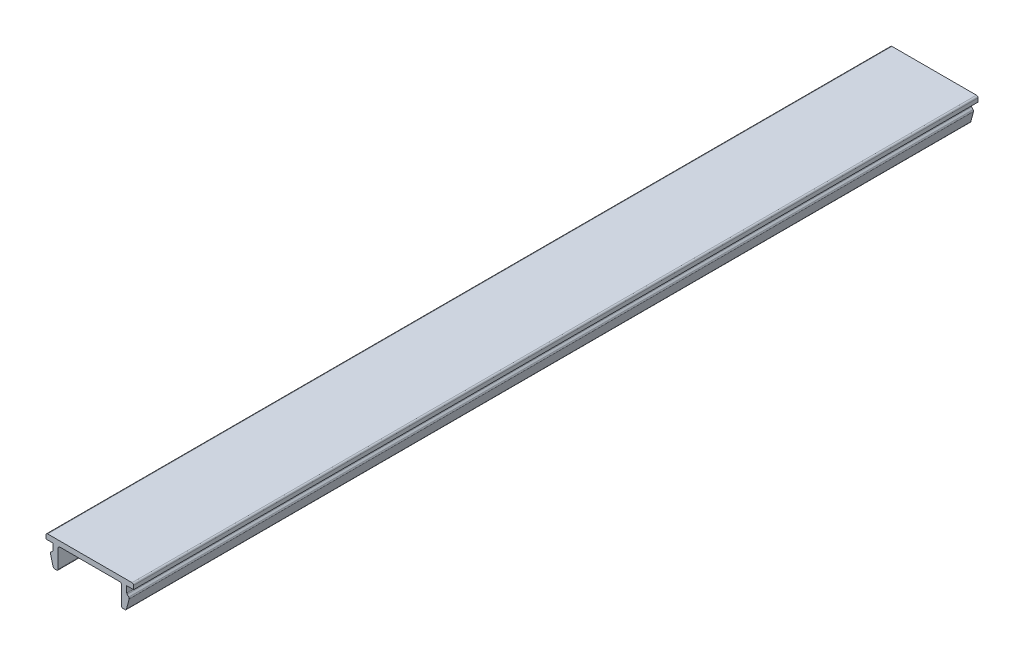
ISO-10303-21;
HEADER;
FILE_DESCRIPTION(('STEP AP214'),'2;1');
FILE_NAME('part.step','',(''),(''),'','','');
FILE_SCHEMA(('AUTOMOTIVE_DESIGN { 1 0 10303 214 1 1 1 1 }'));
ENDSEC;
DATA;
#1=APPLICATION_CONTEXT('core data for automotive mechanical design processes');
#2=APPLICATION_PROTOCOL_DEFINITION('international standard','automotive_design',2000,#1);
#3=PRODUCT_CONTEXT('',#1,'mechanical');
#4=PRODUCT('Part','Part','',(#3));
#5=PRODUCT_RELATED_PRODUCT_CATEGORY('part','',(#4));
#6=PRODUCT_DEFINITION_FORMATION('','',#4);
#7=PRODUCT_DEFINITION_CONTEXT('part definition',#1,'design');
#8=PRODUCT_DEFINITION('design','',#6,#7);
#9=PRODUCT_DEFINITION_SHAPE('','',#8);
#10=(LENGTH_UNIT() NAMED_UNIT(*) SI_UNIT(.MILLI.,.METRE.));
#11=(NAMED_UNIT(*) PLANE_ANGLE_UNIT() SI_UNIT($,.RADIAN.));
#12=(NAMED_UNIT(*) SI_UNIT($,.STERADIAN.) SOLID_ANGLE_UNIT());
#13=UNCERTAINTY_MEASURE_WITH_UNIT(LENGTH_MEASURE(1.E-05),#10,'distance_accuracy_value','');
#14=(GEOMETRIC_REPRESENTATION_CONTEXT(3) GLOBAL_UNCERTAINTY_ASSIGNED_CONTEXT((#13)) GLOBAL_UNIT_ASSIGNED_CONTEXT((#10,
#11,#12)) REPRESENTATION_CONTEXT('',''));
#15=CARTESIAN_POINT('',(0.,0.,0.));
#16=DIRECTION('',(0.,0.,1.));
#17=DIRECTION('',(1.,0.,0.));
#18=AXIS2_PLACEMENT_3D('',#15,#16,#17);
#19=CARTESIAN_POINT('',(-8.3,1.,160.));
#20=DIRECTION('',(1.,0.,0.));
#21=DIRECTION('',(0.,0.,-1.));
#22=AXIS2_PLACEMENT_3D('',#19,#20,#21);
#23=PLANE('',#22);
#24=DIRECTION('',(0.,-1.,0.));
#25=VECTOR('',#24,1.);
#26=CARTESIAN_POINT('',(-8.3,1.,160.));
#27=LINE('',#26,#25);
#28=CARTESIAN_POINT('',(-8.3,0.7,160.));
#29=VERTEX_POINT('',#28);
#30=CARTESIAN_POINT('',(-8.3,0.,160.));
#31=VERTEX_POINT('',#30);
#32=EDGE_CURVE('E224',#29,#31,#27,.T.);
#33=ORIENTED_EDGE('',*,*,#32,.F.);
#34=DIRECTION('',(0.,0.,-1.));
#35=VECTOR('',#34,1.);
#36=CARTESIAN_POINT('',(-8.3,0.7,160.));
#37=LINE('',#36,#35);
#38=CARTESIAN_POINT('',(-8.3,0.7,0.));
#39=VERTEX_POINT('',#38);
#40=EDGE_CURVE('E387',#29,#39,#37,.T.);
#41=ORIENTED_EDGE('',*,*,#40,.T.);
#42=DIRECTION('',(0.,-1.,0.));
#43=VECTOR('',#42,1.);
#44=CARTESIAN_POINT('',(-8.3,1.,0.));
#45=LINE('',#44,#43);
#46=CARTESIAN_POINT('',(-8.3,0.,0.));
#47=VERTEX_POINT('',#46);
#48=EDGE_CURVE('E252',#39,#47,#45,.T.);
#49=ORIENTED_EDGE('',*,*,#48,.T.);
#50=DIRECTION('',(0.,0.,-1.));
#51=VECTOR('',#50,1.);
#52=CARTESIAN_POINT('',(-8.3,0.,160.));
#53=LINE('',#52,#51);
#54=EDGE_CURVE('E244',#31,#47,#53,.T.);
#55=ORIENTED_EDGE('',*,*,#54,.F.);
#56=EDGE_LOOP('',(#33,#41,#49,#55));
#57=FACE_BOUND('',#56,.T.);
#58=ADVANCED_FACE('F39',(#57),#23,.F.);
#59=CARTESIAN_POINT('',(-8.3,0.,160.));
#60=DIRECTION('',(0.,1.,0.));
#61=DIRECTION('',(0.,0.,1.));
#62=AXIS2_PLACEMENT_3D('',#59,#60,#61);
#63=PLANE('',#62);
#64=DIRECTION('',(1.,0.,0.));
#65=VECTOR('',#64,1.);
#66=CARTESIAN_POINT('',(-8.3,0.,0.));
#67=LINE('',#66,#65);
#68=CARTESIAN_POINT('',(-7.,0.,0.));
#69=VERTEX_POINT('',#68);
#70=EDGE_CURVE('E422',#47,#69,#67,.T.);
#71=ORIENTED_EDGE('',*,*,#70,.T.);
#72=DIRECTION('',(0.,0.,-1.));
#73=VECTOR('',#72,1.);
#74=CARTESIAN_POINT('',(-7.,0.,160.));
#75=LINE('',#74,#73);
#76=CARTESIAN_POINT('',(-7.,0.,160.));
#77=VERTEX_POINT('',#76);
#78=EDGE_CURVE('E246',#77,#69,#75,.T.);
#79=ORIENTED_EDGE('',*,*,#78,.F.);
#80=DIRECTION('',(1.,0.,0.));
#81=VECTOR('',#80,1.);
#82=CARTESIAN_POINT('',(-8.3,0.,160.));
#83=LINE('',#82,#81);
#84=EDGE_CURVE('E229',#31,#77,#83,.T.);
#85=ORIENTED_EDGE('',*,*,#84,.F.);
#86=ORIENTED_EDGE('',*,*,#54,.T.);
#87=EDGE_LOOP('',(#71,#79,#85,#86));
#88=FACE_BOUND('',#87,.T.);
#89=ADVANCED_FACE('F243',(#88),#63,.F.);
#90=CARTESIAN_POINT('',(-7.,0.,160.));
#91=DIRECTION('',(1.,0.,0.));
#92=DIRECTION('',(0.,0.,-1.));
#93=AXIS2_PLACEMENT_3D('',#90,#91,#92);
#94=PLANE('',#93);
#95=DIRECTION('',(0.,-1.,0.));
#96=VECTOR('',#95,1.);
#97=CARTESIAN_POINT('',(-7.,0.,0.));
#98=LINE('',#97,#96);
#99=CARTESIAN_POINT('',(-7.,-1.17573593128807,0.));
#100=VERTEX_POINT('',#99);
#101=EDGE_CURVE('E413',#69,#100,#98,.T.);
#102=ORIENTED_EDGE('',*,*,#101,.T.);
#103=DIRECTION('',(0.,0.,-1.));
#104=VECTOR('',#103,1.);
#105=CARTESIAN_POINT('',(-7.,-1.17573593128807,160.));
#106=LINE('',#105,#104);
#107=CARTESIAN_POINT('',(-7.,-1.17573593128807,160.));
#108=VERTEX_POINT('',#107);
#109=EDGE_CURVE('E384',#100,#108,#106,.F.);
#110=ORIENTED_EDGE('',*,*,#109,.T.);
#111=DIRECTION('',(0.,-1.,0.));
#112=VECTOR('',#111,1.);
#113=CARTESIAN_POINT('',(-7.,0.,160.));
#114=LINE('',#113,#112);
#115=EDGE_CURVE('E249',#77,#108,#114,.T.);
#116=ORIENTED_EDGE('',*,*,#115,.F.);
#117=ORIENTED_EDGE('',*,*,#78,.T.);
#118=EDGE_LOOP('',(#102,#110,#116,#117));
#119=FACE_BOUND('',#118,.T.);
#120=ADVANCED_FACE('F420',(#119),#94,.F.);
#121=CARTESIAN_POINT('',(-7.,-1.3,160.));
#122=DIRECTION('',(0.707106781186547,-0.707106781186548,0.));
#123=DIRECTION('',(0.707106781186548,0.707106781186547,0.));
#124=AXIS2_PLACEMENT_3D('',#121,#122,#123);
#125=PLANE('',#124);
#126=DIRECTION('',(-0.707106781186548,-0.707106781186547,0.));
#127=VECTOR('',#126,1.);
#128=CARTESIAN_POINT('',(-7.,-1.3,0.));
#129=LINE('',#128,#127);
#130=CARTESIAN_POINT('',(-7.08786796564404,-1.38786796564404,0.));
#131=VERTEX_POINT('',#130);
#132=CARTESIAN_POINT('',(-7.37752551286084,-1.67752551286084,0.));
#133=VERTEX_POINT('',#132);
#134=EDGE_CURVE('E415',#131,#133,#129,.T.);
#135=ORIENTED_EDGE('',*,*,#134,.T.);
#136=DIRECTION('',(0.,0.,-1.));
#137=VECTOR('',#136,1.);
#138=CARTESIAN_POINT('',(-7.37752551286084,-1.67752551286084,160.));
#139=LINE('',#138,#137);
#140=CARTESIAN_POINT('',(-7.37752551286084,-1.67752551286084,160.));
#141=VERTEX_POINT('',#140);
#142=EDGE_CURVE('E381',#133,#141,#139,.F.);
#143=ORIENTED_EDGE('',*,*,#142,.T.);
#144=DIRECTION('',(-0.707106781186548,-0.707106781186547,0.));
#145=VECTOR('',#144,1.);
#146=CARTESIAN_POINT('',(-7.,-1.3,160.));
#147=LINE('',#146,#145);
#148=CARTESIAN_POINT('',(-7.08786796564404,-1.38786796564404,160.));
#149=VERTEX_POINT('',#148);
#150=EDGE_CURVE('E428',#149,#141,#147,.T.);
#151=ORIENTED_EDGE('',*,*,#150,.F.);
#152=DIRECTION('',(0.,0.,-1.));
#153=VECTOR('',#152,1.);
#154=CARTESIAN_POINT('',(-7.08786796564404,-1.38786796564404,0.));
#155=LINE('',#154,#153);
#156=EDGE_CURVE('E377',#149,#131,#155,.T.);
#157=ORIENTED_EDGE('',*,*,#156,.T.);
#158=EDGE_LOOP('',(#135,#143,#151,#157));
#159=FACE_BOUND('',#158,.T.);
#160=ADVANCED_FACE('F431',(#159),#125,.F.);
#161=CARTESIAN_POINT('',(-7.5,-1.8,160.));
#162=DIRECTION('',(0.965925826289068,0.258819045102522,0.));
#163=DIRECTION('',(-0.258819045102522,0.965925826289068,0.));
#164=AXIS2_PLACEMENT_3D('',#161,#162,#163);
#165=PLANE('',#164);
#166=DIRECTION('',(0.258819045102522,-0.965925826289068,0.));
#167=VECTOR('',#166,1.);
#168=CARTESIAN_POINT('',(-7.5,-1.8,0.));
#169=LINE('',#168,#167);
#170=CARTESIAN_POINT('',(-7.4551712263916,-1.96730326074756,0.));
#171=VERTEX_POINT('',#170);
#172=CARTESIAN_POINT('',(-6.94329650890145,-3.87764571353076,0.));
#173=VERTEX_POINT('',#172);
#174=EDGE_CURVE('E488',#171,#173,#169,.T.);
#175=ORIENTED_EDGE('',*,*,#174,.T.);
#176=DIRECTION('',(0.,0.,-1.));
#177=VECTOR('',#176,1.);
#178=CARTESIAN_POINT('',(-6.94329650890145,-3.87764571353076,160.));
#179=LINE('',#178,#177);
#180=CARTESIAN_POINT('',(-6.94329650890145,-3.87764571353076,160.));
#181=VERTEX_POINT('',#180);
#182=EDGE_CURVE('E374',#173,#181,#179,.F.);
#183=ORIENTED_EDGE('',*,*,#182,.T.);
#184=DIRECTION('',(0.258819045102522,-0.965925826289068,0.));
#185=VECTOR('',#184,1.);
#186=CARTESIAN_POINT('',(-7.5,-1.8,160.));
#187=LINE('',#186,#185);
#188=CARTESIAN_POINT('',(-7.4551712263916,-1.96730326074756,160.));
#189=VERTEX_POINT('',#188);
#190=EDGE_CURVE('E434',#189,#181,#187,.T.);
#191=ORIENTED_EDGE('',*,*,#190,.F.);
#192=DIRECTION('',(0.,0.,-1.));
#193=VECTOR('',#192,1.);
#194=CARTESIAN_POINT('',(-7.4551712263916,-1.96730326074756,160.));
#195=LINE('',#194,#193);
#196=EDGE_CURVE('E370',#189,#171,#195,.T.);
#197=ORIENTED_EDGE('',*,*,#196,.T.);
#198=EDGE_LOOP('',(#175,#183,#191,#197));
#199=FACE_BOUND('',#198,.T.);
#200=ADVANCED_FACE('F613',(#199),#165,.F.);
#201=CARTESIAN_POINT('',(-6.,-4.1,160.));
#202=DIRECTION('',(0.,1.,0.));
#203=DIRECTION('',(0.,0.,1.));
#204=AXIS2_PLACEMENT_3D('',#201,#202,#203);
#205=PLANE('',#204);
#206=DIRECTION('',(1.,0.,0.));
#207=VECTOR('',#206,1.);
#208=CARTESIAN_POINT('',(-6.,-4.1,0.));
#209=LINE('',#208,#207);
#210=CARTESIAN_POINT('',(-6.65351876101473,-4.1,0.));
#211=VERTEX_POINT('',#210);
#212=CARTESIAN_POINT('',(-6.3,-4.1,0.));
#213=VERTEX_POINT('',#212);
#214=EDGE_CURVE('E492',#211,#213,#209,.T.);
#215=ORIENTED_EDGE('',*,*,#214,.T.);
#216=DIRECTION('',(0.,0.,-1.));
#217=VECTOR('',#216,1.);
#218=CARTESIAN_POINT('',(-6.3,-4.1,160.));
#219=LINE('',#218,#217);
#220=CARTESIAN_POINT('',(-6.3,-4.1,160.));
#221=VERTEX_POINT('',#220);
#222=EDGE_CURVE('E367',#213,#221,#219,.F.);
#223=ORIENTED_EDGE('',*,*,#222,.T.);
#224=DIRECTION('',(1.,0.,0.));
#225=VECTOR('',#224,1.);
#226=CARTESIAN_POINT('',(-6.,-4.1,160.));
#227=LINE('',#226,#225);
#228=CARTESIAN_POINT('',(-6.65351876101473,-4.1,160.));
#229=VERTEX_POINT('',#228);
#230=EDGE_CURVE('E439',#229,#221,#227,.T.);
#231=ORIENTED_EDGE('',*,*,#230,.F.);
#232=DIRECTION('',(0.,0.,-1.));
#233=VECTOR('',#232,1.);
#234=CARTESIAN_POINT('',(-6.65351876101473,-4.1,160.));
#235=LINE('',#234,#233);
#236=EDGE_CURVE('E363',#229,#211,#235,.T.);
#237=ORIENTED_EDGE('',*,*,#236,.T.);
#238=EDGE_LOOP('',(#215,#223,#231,#237));
#239=FACE_BOUND('',#238,.T.);
#240=ADVANCED_FACE('F620',(#239),#205,.F.);
#241=CARTESIAN_POINT('',(-6.,0.,160.));
#242=DIRECTION('',(-1.,0.,0.));
#243=DIRECTION('',(0.,-1.,0.));
#244=AXIS2_PLACEMENT_3D('',#241,#242,#243);
#245=PLANE('',#244);
#246=DIRECTION('',(0.,1.,0.));
#247=VECTOR('',#246,1.);
#248=CARTESIAN_POINT('',(-6.,0.,0.));
#249=LINE('',#248,#247);
#250=CARTESIAN_POINT('',(-6.,-3.8,0.));
#251=VERTEX_POINT('',#250);
#252=CARTESIAN_POINT('',(-6.,-0.3,0.));
#253=VERTEX_POINT('',#252);
#254=EDGE_CURVE('E496',#251,#253,#249,.T.);
#255=ORIENTED_EDGE('',*,*,#254,.T.);
#256=DIRECTION('',(0.,0.,-1.));
#257=VECTOR('',#256,1.);
#258=CARTESIAN_POINT('',(-6.,-0.3,160.));
#259=LINE('',#258,#257);
#260=CARTESIAN_POINT('',(-6.,-0.3,160.));
#261=VERTEX_POINT('',#260);
#262=EDGE_CURVE('E360',#253,#261,#259,.F.);
#263=ORIENTED_EDGE('',*,*,#262,.T.);
#264=DIRECTION('',(0.,1.,0.));
#265=VECTOR('',#264,1.);
#266=CARTESIAN_POINT('',(-6.,0.,160.));
#267=LINE('',#266,#265);
#268=CARTESIAN_POINT('',(-6.,-3.8,160.));
#269=VERTEX_POINT('',#268);
#270=EDGE_CURVE('E446',#269,#261,#267,.T.);
#271=ORIENTED_EDGE('',*,*,#270,.F.);
#272=DIRECTION('',(0.,0.,-1.));
#273=VECTOR('',#272,1.);
#274=CARTESIAN_POINT('',(-6.,-3.8,160.));
#275=LINE('',#274,#273);
#276=EDGE_CURVE('E356',#269,#251,#275,.T.);
#277=ORIENTED_EDGE('',*,*,#276,.T.);
#278=EDGE_LOOP('',(#255,#263,#271,#277));
#279=FACE_BOUND('',#278,.T.);
#280=ADVANCED_FACE('F627',(#279),#245,.F.);
#281=CARTESIAN_POINT('',(-6.,0.,160.));
#282=DIRECTION('',(0.,1.,0.));
#283=DIRECTION('',(0.,0.,1.));
#284=AXIS2_PLACEMENT_3D('',#281,#282,#283);
#285=PLANE('',#284);
#286=DIRECTION('',(1.,0.,0.));
#287=VECTOR('',#286,1.);
#288=CARTESIAN_POINT('',(-6.,0.,0.));
#289=LINE('',#288,#287);
#290=CARTESIAN_POINT('',(-5.7,0.,0.));
#291=VERTEX_POINT('',#290);
#292=CARTESIAN_POINT('',(5.69999999999999,0.,0.));
#293=VERTEX_POINT('',#292);
#294=EDGE_CURVE('E500',#291,#293,#289,.T.);
#295=ORIENTED_EDGE('',*,*,#294,.T.);
#296=DIRECTION('',(0.,0.,-1.));
#297=VECTOR('',#296,1.);
#298=CARTESIAN_POINT('',(5.69999999999999,0.,160.));
#299=LINE('',#298,#297);
#300=CARTESIAN_POINT('',(5.69999999999999,0.,160.));
#301=VERTEX_POINT('',#300);
#302=EDGE_CURVE('E353',#293,#301,#299,.F.);
#303=ORIENTED_EDGE('',*,*,#302,.T.);
#304=DIRECTION('',(1.,0.,0.));
#305=VECTOR('',#304,1.);
#306=CARTESIAN_POINT('',(-6.,0.,160.));
#307=LINE('',#306,#305);
#308=CARTESIAN_POINT('',(-5.7,0.,160.));
#309=VERTEX_POINT('',#308);
#310=EDGE_CURVE('E450',#309,#301,#307,.T.);
#311=ORIENTED_EDGE('',*,*,#310,.F.);
#312=DIRECTION('',(0.,0.,-1.));
#313=VECTOR('',#312,1.);
#314=CARTESIAN_POINT('',(-5.7,0.,0.));
#315=LINE('',#314,#313);
#316=EDGE_CURVE('E349',#309,#291,#315,.T.);
#317=ORIENTED_EDGE('',*,*,#316,.T.);
#318=EDGE_LOOP('',(#295,#303,#311,#317));
#319=FACE_BOUND('',#318,.T.);
#320=ADVANCED_FACE('F634',(#319),#285,.F.);
#321=CARTESIAN_POINT('',(5.99999999999999,0.,160.));
#322=DIRECTION('',(1.,0.,0.));
#323=DIRECTION('',(0.,1.,0.));
#324=AXIS2_PLACEMENT_3D('',#321,#322,#323);
#325=PLANE('',#324);
#326=DIRECTION('',(0.,-1.,0.));
#327=VECTOR('',#326,1.);
#328=CARTESIAN_POINT('',(5.99999999999999,0.,0.));
#329=LINE('',#328,#327);
#330=CARTESIAN_POINT('',(5.99999999999999,-0.3,0.));
#331=VERTEX_POINT('',#330);
#332=CARTESIAN_POINT('',(5.99999999999999,-3.8,0.));
#333=VERTEX_POINT('',#332);
#334=EDGE_CURVE('E504',#331,#333,#329,.T.);
#335=ORIENTED_EDGE('',*,*,#334,.T.);
#336=DIRECTION('',(0.,0.,-1.));
#337=VECTOR('',#336,1.);
#338=CARTESIAN_POINT('',(5.99999999999999,-3.8,160.));
#339=LINE('',#338,#337);
#340=CARTESIAN_POINT('',(5.99999999999999,-3.8,160.));
#341=VERTEX_POINT('',#340);
#342=EDGE_CURVE('E346',#333,#341,#339,.F.);
#343=ORIENTED_EDGE('',*,*,#342,.T.);
#344=DIRECTION('',(0.,-1.,0.));
#345=VECTOR('',#344,1.);
#346=CARTESIAN_POINT('',(5.99999999999999,0.,160.));
#347=LINE('',#346,#345);
#348=CARTESIAN_POINT('',(5.99999999999999,-0.3,160.));
#349=VERTEX_POINT('',#348);
#350=EDGE_CURVE('E454',#349,#341,#347,.T.);
#351=ORIENTED_EDGE('',*,*,#350,.F.);
#352=DIRECTION('',(0.,0.,-1.));
#353=VECTOR('',#352,1.);
#354=CARTESIAN_POINT('',(5.99999999999999,-0.3,0.));
#355=LINE('',#354,#353);
#356=EDGE_CURVE('E342',#349,#331,#355,.T.);
#357=ORIENTED_EDGE('',*,*,#356,.T.);
#358=EDGE_LOOP('',(#335,#343,#351,#357));
#359=FACE_BOUND('',#358,.T.);
#360=ADVANCED_FACE('F641',(#359),#325,.F.);
#361=CARTESIAN_POINT('',(5.99999999999999,-4.1,160.));
#362=DIRECTION('',(0.,1.,0.));
#363=DIRECTION('',(0.,0.,1.));
#364=AXIS2_PLACEMENT_3D('',#361,#362,#363);
#365=PLANE('',#364);
#366=DIRECTION('',(1.,0.,0.));
#367=VECTOR('',#366,1.);
#368=CARTESIAN_POINT('',(5.99999999999999,-4.1,0.));
#369=LINE('',#368,#367);
#370=CARTESIAN_POINT('',(6.29999999999999,-4.1,0.));
#371=VERTEX_POINT('',#370);
#372=CARTESIAN_POINT('',(6.65351876101472,-4.1,0.));
#373=VERTEX_POINT('',#372);
#374=EDGE_CURVE('E508',#371,#373,#369,.T.);
#375=ORIENTED_EDGE('',*,*,#374,.T.);
#376=DIRECTION('',(0.,0.,-1.));
#377=VECTOR('',#376,1.);
#378=CARTESIAN_POINT('',(6.65351876101472,-4.1,160.));
#379=LINE('',#378,#377);
#380=CARTESIAN_POINT('',(6.65351876101472,-4.1,160.));
#381=VERTEX_POINT('',#380);
#382=EDGE_CURVE('E339',#373,#381,#379,.F.);
#383=ORIENTED_EDGE('',*,*,#382,.T.);
#384=DIRECTION('',(1.,0.,0.));
#385=VECTOR('',#384,1.);
#386=CARTESIAN_POINT('',(5.99999999999999,-4.1,160.));
#387=LINE('',#386,#385);
#388=CARTESIAN_POINT('',(6.29999999999999,-4.1,160.));
#389=VERTEX_POINT('',#388);
#390=EDGE_CURVE('E458',#389,#381,#387,.T.);
#391=ORIENTED_EDGE('',*,*,#390,.F.);
#392=DIRECTION('',(0.,0.,-1.));
#393=VECTOR('',#392,1.);
#394=CARTESIAN_POINT('',(6.29999999999999,-4.1,160.));
#395=LINE('',#394,#393);
#396=EDGE_CURVE('E335',#389,#371,#395,.T.);
#397=ORIENTED_EDGE('',*,*,#396,.T.);
#398=EDGE_LOOP('',(#375,#383,#391,#397));
#399=FACE_BOUND('',#398,.T.);
#400=ADVANCED_FACE('F648',(#399),#365,.F.);
#401=CARTESIAN_POINT('',(7.49999999999999,-1.8,160.));
#402=DIRECTION('',(-0.965925826289068,0.258819045102522,0.));
#403=DIRECTION('',(-0.258819045102522,-0.965925826289068,0.));
#404=AXIS2_PLACEMENT_3D('',#401,#402,#403);
#405=PLANE('',#404);
#406=DIRECTION('',(0.258819045102522,0.965925826289068,0.));
#407=VECTOR('',#406,1.);
#408=CARTESIAN_POINT('',(7.49999999999999,-1.8,0.));
#409=LINE('',#408,#407);
#410=CARTESIAN_POINT('',(6.94329650890144,-3.87764571353075,0.));
#411=VERTEX_POINT('',#410);
#412=CARTESIAN_POINT('',(7.45517122639159,-1.96730326074756,0.));
#413=VERTEX_POINT('',#412);
#414=EDGE_CURVE('E512',#411,#413,#409,.T.);
#415=ORIENTED_EDGE('',*,*,#414,.T.);
#416=DIRECTION('',(0.,0.,-1.));
#417=VECTOR('',#416,1.);
#418=CARTESIAN_POINT('',(7.45517122639159,-1.96730326074756,160.));
#419=LINE('',#418,#417);
#420=CARTESIAN_POINT('',(7.45517122639159,-1.96730326074756,160.));
#421=VERTEX_POINT('',#420);
#422=EDGE_CURVE('E332',#413,#421,#419,.F.);
#423=ORIENTED_EDGE('',*,*,#422,.T.);
#424=DIRECTION('',(0.258819045102522,0.965925826289068,0.));
#425=VECTOR('',#424,1.);
#426=CARTESIAN_POINT('',(7.49999999999999,-1.8,160.));
#427=LINE('',#426,#425);
#428=CARTESIAN_POINT('',(6.94329650890144,-3.87764571353075,160.));
#429=VERTEX_POINT('',#428);
#430=EDGE_CURVE('E462',#429,#421,#427,.T.);
#431=ORIENTED_EDGE('',*,*,#430,.F.);
#432=DIRECTION('',(0.,0.,-1.));
#433=VECTOR('',#432,1.);
#434=CARTESIAN_POINT('',(6.94329650890144,-3.87764571353075,160.));
#435=LINE('',#434,#433);
#436=EDGE_CURVE('E328',#429,#411,#435,.T.);
#437=ORIENTED_EDGE('',*,*,#436,.T.);
#438=EDGE_LOOP('',(#415,#423,#431,#437));
#439=FACE_BOUND('',#438,.T.);
#440=ADVANCED_FACE('F655',(#439),#405,.F.);
#441=CARTESIAN_POINT('',(6.99999999999999,-1.3,160.));
#442=DIRECTION('',(-0.707106781186547,-0.707106781186548,0.));
#443=DIRECTION('',(0.707106781186548,-0.707106781186547,0.));
#444=AXIS2_PLACEMENT_3D('',#441,#442,#443);
#445=PLANE('',#444);
#446=DIRECTION('',(-0.707106781186548,0.707106781186547,0.));
#447=VECTOR('',#446,1.);
#448=CARTESIAN_POINT('',(6.99999999999999,-1.3,0.));
#449=LINE('',#448,#447);
#450=CARTESIAN_POINT('',(7.37752551286083,-1.67752551286084,0.));
#451=VERTEX_POINT('',#450);
#452=CARTESIAN_POINT('',(7.08786796564403,-1.38786796564403,0.));
#453=VERTEX_POINT('',#452);
#454=EDGE_CURVE('E516',#451,#453,#449,.T.);
#455=ORIENTED_EDGE('',*,*,#454,.T.);
#456=DIRECTION('',(0.,0.,-1.));
#457=VECTOR('',#456,1.);
#458=CARTESIAN_POINT('',(7.08786796564403,-1.38786796564403,160.));
#459=LINE('',#458,#457);
#460=CARTESIAN_POINT('',(7.08786796564403,-1.38786796564403,160.));
#461=VERTEX_POINT('',#460);
#462=EDGE_CURVE('E63',#453,#461,#459,.F.);
#463=ORIENTED_EDGE('',*,*,#462,.T.);
#464=DIRECTION('',(-0.707106781186548,0.707106781186547,0.));
#465=VECTOR('',#464,1.);
#466=CARTESIAN_POINT('',(6.99999999999999,-1.3,160.));
#467=LINE('',#466,#465);
#468=CARTESIAN_POINT('',(7.37752551286083,-1.67752551286084,160.));
#469=VERTEX_POINT('',#468);
#470=EDGE_CURVE('E466',#469,#461,#467,.T.);
#471=ORIENTED_EDGE('',*,*,#470,.F.);
#472=DIRECTION('',(0.,0.,-1.));
#473=VECTOR('',#472,1.);
#474=CARTESIAN_POINT('',(7.37752551286083,-1.67752551286084,160.));
#475=LINE('',#474,#473);
#476=EDGE_CURVE('E322',#469,#451,#475,.T.);
#477=ORIENTED_EDGE('',*,*,#476,.T.);
#478=EDGE_LOOP('',(#455,#463,#471,#477));
#479=FACE_BOUND('',#478,.T.);
#480=ADVANCED_FACE('F659',(#479),#445,.F.);
#481=CARTESIAN_POINT('',(6.99999999999999,0.,160.));
#482=DIRECTION('',(-1.,0.,0.));
#483=DIRECTION('',(0.,0.,1.));
#484=AXIS2_PLACEMENT_3D('',#481,#482,#483);
#485=PLANE('',#484);
#486=DIRECTION('',(0.,1.,0.));
#487=VECTOR('',#486,1.);
#488=CARTESIAN_POINT('',(6.99999999999999,0.,160.));
#489=LINE('',#488,#487);
#490=CARTESIAN_POINT('',(6.99999999999999,-1.17573593128807,160.));
#491=VERTEX_POINT('',#490);
#492=CARTESIAN_POINT('',(6.99999999999999,0.,160.));
#493=VERTEX_POINT('',#492);
#494=EDGE_CURVE('E469',#491,#493,#489,.T.);
#495=ORIENTED_EDGE('',*,*,#494,.F.);
#496=DIRECTION('',(0.,0.,-1.));
#497=VECTOR('',#496,1.);
#498=CARTESIAN_POINT('',(6.99999999999999,-1.17573593128807,0.));
#499=LINE('',#498,#497);
#500=CARTESIAN_POINT('',(6.99999999999999,-1.17573593128807,0.));
#501=VERTEX_POINT('',#500);
#502=EDGE_CURVE('E318',#491,#501,#499,.T.);
#503=ORIENTED_EDGE('',*,*,#502,.T.);
#504=DIRECTION('',(0.,1.,0.));
#505=VECTOR('',#504,1.);
#506=CARTESIAN_POINT('',(6.99999999999999,0.,0.));
#507=LINE('',#506,#505);
#508=CARTESIAN_POINT('',(6.99999999999999,0.,0.));
#509=VERTEX_POINT('',#508);
#510=EDGE_CURVE('E519',#501,#509,#507,.T.);
#511=ORIENTED_EDGE('',*,*,#510,.T.);
#512=DIRECTION('',(0.,0.,-1.));
#513=VECTOR('',#512,1.);
#514=CARTESIAN_POINT('',(6.99999999999999,0.,160.));
#515=LINE('',#514,#513);
#516=EDGE_CURVE('E261',#493,#509,#515,.T.);
#517=ORIENTED_EDGE('',*,*,#516,.F.);
#518=EDGE_LOOP('',(#495,#503,#511,#517));
#519=FACE_BOUND('',#518,.T.);
#520=ADVANCED_FACE('F662',(#519),#485,.F.);
#521=CARTESIAN_POINT('',(6.99999999999999,0.,160.));
#522=DIRECTION('',(0.,1.,0.));
#523=DIRECTION('',(0.,0.,1.));
#524=AXIS2_PLACEMENT_3D('',#521,#522,#523);
#525=PLANE('',#524);
#526=DIRECTION('',(1.,0.,0.));
#527=VECTOR('',#526,1.);
#528=CARTESIAN_POINT('',(6.99999999999999,0.,0.));
#529=LINE('',#528,#527);
#530=CARTESIAN_POINT('',(8.3,0.,0.));
#531=VERTEX_POINT('',#530);
#532=EDGE_CURVE('E522',#509,#531,#529,.T.);
#533=ORIENTED_EDGE('',*,*,#532,.T.);
#534=DIRECTION('',(0.,0.,-1.));
#535=VECTOR('',#534,1.);
#536=CARTESIAN_POINT('',(8.3,0.,160.));
#537=LINE('',#536,#535);
#538=CARTESIAN_POINT('',(8.3,0.,160.));
#539=VERTEX_POINT('',#538);
#540=EDGE_CURVE('E481',#539,#531,#537,.T.);
#541=ORIENTED_EDGE('',*,*,#540,.F.);
#542=DIRECTION('',(1.,0.,0.));
#543=VECTOR('',#542,1.);
#544=CARTESIAN_POINT('',(6.99999999999999,0.,160.));
#545=LINE('',#544,#543);
#546=EDGE_CURVE('E472',#493,#539,#545,.T.);
#547=ORIENTED_EDGE('',*,*,#546,.F.);
#548=ORIENTED_EDGE('',*,*,#516,.T.);
#549=EDGE_LOOP('',(#533,#541,#547,#548));
#550=FACE_BOUND('',#549,.T.);
#551=ADVANCED_FACE('F540',(#550),#525,.F.);
#552=CARTESIAN_POINT('',(8.3,1.,160.));
#553=DIRECTION('',(-1.,0.,0.));
#554=DIRECTION('',(0.,0.,1.));
#555=AXIS2_PLACEMENT_3D('',#552,#553,#554);
#556=PLANE('',#555);
#557=DIRECTION('',(0.,1.,0.));
#558=VECTOR('',#557,1.);
#559=CARTESIAN_POINT('',(8.3,1.,0.));
#560=LINE('',#559,#558);
#561=CARTESIAN_POINT('',(8.3,0.700000000000004,0.));
#562=VERTEX_POINT('',#561);
#563=EDGE_CURVE('E525',#531,#562,#560,.T.);
#564=ORIENTED_EDGE('',*,*,#563,.T.);
#565=DIRECTION('',(0.,0.,-1.));
#566=VECTOR('',#565,1.);
#567=CARTESIAN_POINT('',(8.3,0.700000000000004,160.));
#568=LINE('',#567,#566);
#569=CARTESIAN_POINT('',(8.3,0.700000000000004,160.));
#570=VERTEX_POINT('',#569);
#571=EDGE_CURVE('E292',#562,#570,#568,.F.);
#572=ORIENTED_EDGE('',*,*,#571,.T.);
#573=DIRECTION('',(0.,1.,0.));
#574=VECTOR('',#573,1.);
#575=CARTESIAN_POINT('',(8.3,1.,160.));
#576=LINE('',#575,#574);
#577=EDGE_CURVE('E475',#539,#570,#576,.T.);
#578=ORIENTED_EDGE('',*,*,#577,.F.);
#579=ORIENTED_EDGE('',*,*,#540,.T.);
#580=EDGE_LOOP('',(#564,#572,#578,#579));
#581=FACE_BOUND('',#580,.T.);
#582=ADVANCED_FACE('F547',(#581),#556,.F.);
#583=CARTESIAN_POINT('',(-8.3,1.,160.));
#584=DIRECTION('',(0.,-1.,0.));
#585=DIRECTION('',(1.,0.,0.));
#586=AXIS2_PLACEMENT_3D('',#583,#584,#585);
#587=PLANE('',#586);
#588=DIRECTION('',(-1.,0.,0.));
#589=VECTOR('',#588,1.);
#590=CARTESIAN_POINT('',(-8.3,1.,160.));
#591=LINE('',#590,#589);
#592=CARTESIAN_POINT('',(7.99999999999999,1.,160.));
#593=VERTEX_POINT('',#592);
#594=CARTESIAN_POINT('',(-8.,1.,160.));
#595=VERTEX_POINT('',#594);
#596=EDGE_CURVE('E478',#593,#595,#591,.T.);
#597=ORIENTED_EDGE('',*,*,#596,.F.);
#598=DIRECTION('',(0.,0.,-1.));
#599=VECTOR('',#598,1.);
#600=CARTESIAN_POINT('',(8.,1.,160.));
#601=LINE('',#600,#599);
#602=CARTESIAN_POINT('',(7.99999999999999,1.,0.));
#603=VERTEX_POINT('',#602);
#604=EDGE_CURVE('E259',#593,#603,#601,.T.);
#605=ORIENTED_EDGE('',*,*,#604,.T.);
#606=DIRECTION('',(-1.,0.,0.));
#607=VECTOR('',#606,1.);
#608=CARTESIAN_POINT('',(-8.3,1.,0.));
#609=LINE('',#608,#607);
#610=CARTESIAN_POINT('',(-8.,1.,0.));
#611=VERTEX_POINT('',#610);
#612=EDGE_CURVE('E239',#603,#611,#609,.T.);
#613=ORIENTED_EDGE('',*,*,#612,.T.);
#614=DIRECTION('',(0.,0.,-1.));
#615=VECTOR('',#614,1.);
#616=CARTESIAN_POINT('',(-8.,1.,160.));
#617=LINE('',#616,#615);
#618=EDGE_CURVE('E255',#611,#595,#617,.F.);
#619=ORIENTED_EDGE('',*,*,#618,.T.);
#620=EDGE_LOOP('',(#597,#605,#613,#619));
#621=FACE_BOUND('',#620,.T.);
#622=ADVANCED_FACE('F555',(#621),#587,.F.);
#623=CARTESIAN_POINT('',(0.,0.,160.));
#624=DIRECTION('',(0.,0.,1.));
#625=DIRECTION('',(1.,0.,0.));
#626=AXIS2_PLACEMENT_3D('',#623,#624,#625);
#627=PLANE('',#626);
#628=ORIENTED_EDGE('',*,*,#577,.T.);
#629=CARTESIAN_POINT('',(8.,0.700000000000004,160.));
#630=DIRECTION('',(0.,0.,1.));
#631=DIRECTION('',(1.,0.,0.));
#632=AXIS2_PLACEMENT_3D('',#629,#630,#631);
#633=CIRCLE('',#632,0.3);
#634=EDGE_CURVE('E315',#570,#593,#633,.T.);
#635=ORIENTED_EDGE('',*,*,#634,.T.);
#636=ORIENTED_EDGE('',*,*,#596,.T.);
#637=CARTESIAN_POINT('',(-8.,0.7,160.));
#638=DIRECTION('',(0.,0.,1.));
#639=DIRECTION('',(1.,0.,0.));
#640=AXIS2_PLACEMENT_3D('',#637,#638,#639);
#641=CIRCLE('',#640,0.3);
#642=EDGE_CURVE('E233',#595,#29,#641,.T.);
#643=ORIENTED_EDGE('',*,*,#642,.T.);
#644=ORIENTED_EDGE('',*,*,#32,.T.);
#645=ORIENTED_EDGE('',*,*,#84,.T.);
#646=ORIENTED_EDGE('',*,*,#115,.T.);
#647=CARTESIAN_POINT('',(-7.3,-1.17573593128807,160.));
#648=DIRECTION('',(0.,0.,1.));
#649=DIRECTION('',(1.,0.,0.));
#650=AXIS2_PLACEMENT_3D('',#647,#648,#649);
#651=CIRCLE('',#650,0.3);
#652=EDGE_CURVE('E11',#108,#149,#651,.F.);
#653=ORIENTED_EDGE('',*,*,#652,.T.);
#654=ORIENTED_EDGE('',*,*,#150,.T.);
#655=CARTESIAN_POINT('',(-7.16539347850488,-1.8896575472168,160.));
#656=DIRECTION('',(0.,0.,1.));
#657=DIRECTION('',(1.,0.,0.));
#658=AXIS2_PLACEMENT_3D('',#655,#656,#657);
#659=CIRCLE('',#658,0.3);
#660=EDGE_CURVE('E297',#141,#189,#659,.T.);
#661=ORIENTED_EDGE('',*,*,#660,.T.);
#662=ORIENTED_EDGE('',*,*,#190,.T.);
#663=CARTESIAN_POINT('',(-6.65351876101473,-3.8,160.));
#664=DIRECTION('',(0.,0.,1.));
#665=DIRECTION('',(1.,0.,0.));
#666=AXIS2_PLACEMENT_3D('',#663,#664,#665);
#667=CIRCLE('',#666,0.3);
#668=EDGE_CURVE('E300',#181,#229,#667,.T.);
#669=ORIENTED_EDGE('',*,*,#668,.T.);
#670=ORIENTED_EDGE('',*,*,#230,.T.);
#671=CARTESIAN_POINT('',(-6.3,-3.8,160.));
#672=DIRECTION('',(0.,0.,1.));
#673=DIRECTION('',(1.,0.,0.));
#674=AXIS2_PLACEMENT_3D('',#671,#672,#673);
#675=CIRCLE('',#674,0.3);
#676=EDGE_CURVE('E303',#221,#269,#675,.T.);
#677=ORIENTED_EDGE('',*,*,#676,.T.);
#678=ORIENTED_EDGE('',*,*,#270,.T.);
#679=CARTESIAN_POINT('',(-5.7,-0.3,160.));
#680=DIRECTION('',(0.,0.,1.));
#681=DIRECTION('',(1.,0.,0.));
#682=AXIS2_PLACEMENT_3D('',#679,#680,#681);
#683=CIRCLE('',#682,0.3);
#684=EDGE_CURVE('E404',#261,#309,#683,.F.);
#685=ORIENTED_EDGE('',*,*,#684,.T.);
#686=ORIENTED_EDGE('',*,*,#310,.T.);
#687=CARTESIAN_POINT('',(5.69999999999999,-0.3,160.));
#688=DIRECTION('',(0.,0.,1.));
#689=DIRECTION('',(1.,0.,0.));
#690=AXIS2_PLACEMENT_3D('',#687,#688,#689);
#691=CIRCLE('',#690,0.3);
#692=EDGE_CURVE('E398',#301,#349,#691,.F.);
#693=ORIENTED_EDGE('',*,*,#692,.T.);
#694=ORIENTED_EDGE('',*,*,#350,.T.);
#695=CARTESIAN_POINT('',(6.29999999999999,-3.8,160.));
#696=DIRECTION('',(0.,0.,1.));
#697=DIRECTION('',(1.,0.,0.));
#698=AXIS2_PLACEMENT_3D('',#695,#696,#697);
#699=CIRCLE('',#698,0.3);
#700=EDGE_CURVE('E306',#341,#389,#699,.T.);
#701=ORIENTED_EDGE('',*,*,#700,.T.);
#702=ORIENTED_EDGE('',*,*,#390,.T.);
#703=CARTESIAN_POINT('',(6.65351876101472,-3.8,160.));
#704=DIRECTION('',(0.,0.,1.));
#705=DIRECTION('',(1.,0.,0.));
#706=AXIS2_PLACEMENT_3D('',#703,#704,#705);
#707=CIRCLE('',#706,0.3);
#708=EDGE_CURVE('E309',#381,#429,#707,.T.);
#709=ORIENTED_EDGE('',*,*,#708,.T.);
#710=ORIENTED_EDGE('',*,*,#430,.T.);
#711=CARTESIAN_POINT('',(7.16539347850487,-1.8896575472168,160.));
#712=DIRECTION('',(0.,0.,1.));
#713=DIRECTION('',(1.,0.,0.));
#714=AXIS2_PLACEMENT_3D('',#711,#712,#713);
#715=CIRCLE('',#714,0.3);
#716=EDGE_CURVE('E312',#421,#469,#715,.T.);
#717=ORIENTED_EDGE('',*,*,#716,.T.);
#718=ORIENTED_EDGE('',*,*,#470,.T.);
#719=CARTESIAN_POINT('',(7.29999999999999,-1.17573593128807,160.));
#720=DIRECTION('',(0.,0.,1.));
#721=DIRECTION('',(1.,0.,0.));
#722=AXIS2_PLACEMENT_3D('',#719,#720,#721);
#723=CIRCLE('',#722,0.3);
#724=EDGE_CURVE('E55',#461,#491,#723,.F.);
#725=ORIENTED_EDGE('',*,*,#724,.T.);
#726=ORIENTED_EDGE('',*,*,#494,.T.);
#727=ORIENTED_EDGE('',*,*,#546,.T.);
#728=EDGE_LOOP('',(#628,#635,#636,#643,#644,#645,#646,#653,#654,#661,#662,#669,#670,#677,#678,
#685,#686,#693,#694,#701,#702,#709,#710,#717,#718,#725,#726,#727));
#729=FACE_BOUND('',#728,.T.);
#730=ADVANCED_FACE('F227',(#729),#627,.T.);
#731=CARTESIAN_POINT('',(0.,0.,0.));
#732=DIRECTION('',(0.,0.,1.));
#733=DIRECTION('',(1.,0.,0.));
#734=AXIS2_PLACEMENT_3D('',#731,#732,#733);
#735=PLANE('',#734);
#736=ORIENTED_EDGE('',*,*,#612,.F.);
#737=CARTESIAN_POINT('',(8.,0.700000000000004,0.));
#738=DIRECTION('',(0.,0.,1.));
#739=DIRECTION('',(1.,0.,0.));
#740=AXIS2_PLACEMENT_3D('',#737,#738,#739);
#741=CIRCLE('',#740,0.3);
#742=EDGE_CURVE('E289',#603,#562,#741,.F.);
#743=ORIENTED_EDGE('',*,*,#742,.T.);
#744=ORIENTED_EDGE('',*,*,#563,.F.);
#745=ORIENTED_EDGE('',*,*,#532,.F.);
#746=ORIENTED_EDGE('',*,*,#510,.F.);
#747=CARTESIAN_POINT('',(7.29999999999999,-1.17573593128807,0.));
#748=DIRECTION('',(0.,0.,1.));
#749=DIRECTION('',(1.,0.,0.));
#750=AXIS2_PLACEMENT_3D('',#747,#748,#749);
#751=CIRCLE('',#750,0.3);
#752=EDGE_CURVE('E390',#501,#453,#751,.T.);
#753=ORIENTED_EDGE('',*,*,#752,.T.);
#754=ORIENTED_EDGE('',*,*,#454,.F.);
#755=CARTESIAN_POINT('',(7.16539347850487,-1.8896575472168,0.));
#756=DIRECTION('',(0.,0.,1.));
#757=DIRECTION('',(1.,0.,0.));
#758=AXIS2_PLACEMENT_3D('',#755,#756,#757);
#759=CIRCLE('',#758,0.3);
#760=EDGE_CURVE('E286',#451,#413,#759,.F.);
#761=ORIENTED_EDGE('',*,*,#760,.T.);
#762=ORIENTED_EDGE('',*,*,#414,.F.);
#763=CARTESIAN_POINT('',(6.65351876101472,-3.8,0.));
#764=DIRECTION('',(0.,0.,1.));
#765=DIRECTION('',(1.,0.,0.));
#766=AXIS2_PLACEMENT_3D('',#763,#764,#765);
#767=CIRCLE('',#766,0.3);
#768=EDGE_CURVE('E283',#411,#373,#767,.F.);
#769=ORIENTED_EDGE('',*,*,#768,.T.);
#770=ORIENTED_EDGE('',*,*,#374,.F.);
#771=CARTESIAN_POINT('',(6.29999999999999,-3.8,0.));
#772=DIRECTION('',(0.,0.,1.));
#773=DIRECTION('',(1.,0.,0.));
#774=AXIS2_PLACEMENT_3D('',#771,#772,#773);
#775=CIRCLE('',#774,0.3);
#776=EDGE_CURVE('E280',#371,#333,#775,.F.);
#777=ORIENTED_EDGE('',*,*,#776,.T.);
#778=ORIENTED_EDGE('',*,*,#334,.F.);
#779=CARTESIAN_POINT('',(5.69999999999999,-0.3,0.));
#780=DIRECTION('',(0.,0.,1.));
#781=DIRECTION('',(1.,0.,0.));
#782=AXIS2_PLACEMENT_3D('',#779,#780,#781);
#783=CIRCLE('',#782,0.3);
#784=EDGE_CURVE('E395',#331,#293,#783,.T.);
#785=ORIENTED_EDGE('',*,*,#784,.T.);
#786=ORIENTED_EDGE('',*,*,#294,.F.);
#787=CARTESIAN_POINT('',(-5.7,-0.3,0.));
#788=DIRECTION('',(0.,0.,1.));
#789=DIRECTION('',(1.,0.,0.));
#790=AXIS2_PLACEMENT_3D('',#787,#788,#789);
#791=CIRCLE('',#790,0.3);
#792=EDGE_CURVE('E401',#291,#253,#791,.T.);
#793=ORIENTED_EDGE('',*,*,#792,.T.);
#794=ORIENTED_EDGE('',*,*,#254,.F.);
#795=CARTESIAN_POINT('',(-6.3,-3.8,0.));
#796=DIRECTION('',(0.,0.,1.));
#797=DIRECTION('',(1.,0.,0.));
#798=AXIS2_PLACEMENT_3D('',#795,#796,#797);
#799=CIRCLE('',#798,0.3);
#800=EDGE_CURVE('E277',#251,#213,#799,.F.);
#801=ORIENTED_EDGE('',*,*,#800,.T.);
#802=ORIENTED_EDGE('',*,*,#214,.F.);
#803=CARTESIAN_POINT('',(-6.65351876101473,-3.8,0.));
#804=DIRECTION('',(0.,0.,1.));
#805=DIRECTION('',(1.,0.,0.));
#806=AXIS2_PLACEMENT_3D('',#803,#804,#805);
#807=CIRCLE('',#806,0.3);
#808=EDGE_CURVE('E274',#211,#173,#807,.F.);
#809=ORIENTED_EDGE('',*,*,#808,.T.);
#810=ORIENTED_EDGE('',*,*,#174,.F.);
#811=CARTESIAN_POINT('',(-7.16539347850488,-1.8896575472168,0.));
#812=DIRECTION('',(0.,0.,1.));
#813=DIRECTION('',(1.,0.,0.));
#814=AXIS2_PLACEMENT_3D('',#811,#812,#813);
#815=CIRCLE('',#814,0.3);
#816=EDGE_CURVE('E271',#171,#133,#815,.F.);
#817=ORIENTED_EDGE('',*,*,#816,.T.);
#818=ORIENTED_EDGE('',*,*,#134,.F.);
#819=CARTESIAN_POINT('',(-7.3,-1.17573593128807,0.));
#820=DIRECTION('',(0.,0.,1.));
#821=DIRECTION('',(1.,0.,0.));
#822=AXIS2_PLACEMENT_3D('',#819,#820,#821);
#823=CIRCLE('',#822,0.3);
#824=EDGE_CURVE('E48',#131,#100,#823,.T.);
#825=ORIENTED_EDGE('',*,*,#824,.T.);
#826=ORIENTED_EDGE('',*,*,#101,.F.);
#827=ORIENTED_EDGE('',*,*,#70,.F.);
#828=ORIENTED_EDGE('',*,*,#48,.F.);
#829=CARTESIAN_POINT('',(-8.,0.7,0.));
#830=DIRECTION('',(0.,0.,1.));
#831=DIRECTION('',(1.,0.,0.));
#832=AXIS2_PLACEMENT_3D('',#829,#830,#831);
#833=CIRCLE('',#832,0.3);
#834=EDGE_CURVE('E268',#39,#611,#833,.F.);
#835=ORIENTED_EDGE('',*,*,#834,.T.);
#836=EDGE_LOOP('',(#736,#743,#744,#745,#746,#753,#754,#761,#762,#769,#770,#777,#778,#785,#786,
#793,#794,#801,#802,#809,#810,#817,#818,#825,#826,#827,#828,#835));
#837=FACE_BOUND('',#836,.T.);
#838=ADVANCED_FACE('F412',(#837),#735,.F.);
#839=CARTESIAN_POINT('',(8.,0.700000000000004,160.));
#840=DIRECTION('',(0.,0.,-1.));
#841=DIRECTION('',(-1.,0.,0.));
#842=AXIS2_PLACEMENT_3D('',#839,#840,#841);
#843=CYLINDRICAL_SURFACE('',#842,0.3);
#844=ORIENTED_EDGE('',*,*,#634,.F.);
#845=ORIENTED_EDGE('',*,*,#571,.F.);
#846=ORIENTED_EDGE('',*,*,#742,.F.);
#847=ORIENTED_EDGE('',*,*,#604,.F.);
#848=EDGE_LOOP('',(#844,#845,#846,#847));
#849=FACE_BOUND('',#848,.T.);
#850=ADVANCED_FACE('F551',(#849),#843,.T.);
#851=CARTESIAN_POINT('',(7.29999999999999,-1.17573593128807,160.));
#852=DIRECTION('',(0.,0.,1.));
#853=DIRECTION('',(1.,0.,0.));
#854=AXIS2_PLACEMENT_3D('',#851,#852,#853);
#855=CYLINDRICAL_SURFACE('',#854,0.3);
#856=ORIENTED_EDGE('',*,*,#724,.F.);
#857=ORIENTED_EDGE('',*,*,#462,.F.);
#858=ORIENTED_EDGE('',*,*,#752,.F.);
#859=ORIENTED_EDGE('',*,*,#502,.F.);
#860=EDGE_LOOP('',(#856,#857,#858,#859));
#861=FACE_BOUND('',#860,.T.);
#862=ADVANCED_FACE('F573',(#861),#855,.F.);
#863=CARTESIAN_POINT('',(7.16539347850487,-1.8896575472168,160.));
#864=DIRECTION('',(0.,0.,-1.));
#865=DIRECTION('',(-1.,0.,0.));
#866=AXIS2_PLACEMENT_3D('',#863,#864,#865);
#867=CYLINDRICAL_SURFACE('',#866,0.3);
#868=ORIENTED_EDGE('',*,*,#716,.F.);
#869=ORIENTED_EDGE('',*,*,#422,.F.);
#870=ORIENTED_EDGE('',*,*,#760,.F.);
#871=ORIENTED_EDGE('',*,*,#476,.F.);
#872=EDGE_LOOP('',(#868,#869,#870,#871));
#873=FACE_BOUND('',#872,.T.);
#874=ADVANCED_FACE('F576',(#873),#867,.T.);
#875=CARTESIAN_POINT('',(6.65351876101472,-3.8,160.));
#876=DIRECTION('',(0.,0.,-1.));
#877=DIRECTION('',(-1.,0.,0.));
#878=AXIS2_PLACEMENT_3D('',#875,#876,#877);
#879=CYLINDRICAL_SURFACE('',#878,0.3);
#880=ORIENTED_EDGE('',*,*,#708,.F.);
#881=ORIENTED_EDGE('',*,*,#382,.F.);
#882=ORIENTED_EDGE('',*,*,#768,.F.);
#883=ORIENTED_EDGE('',*,*,#436,.F.);
#884=EDGE_LOOP('',(#880,#881,#882,#883));
#885=FACE_BOUND('',#884,.T.);
#886=ADVANCED_FACE('F580',(#885),#879,.T.);
#887=CARTESIAN_POINT('',(6.29999999999999,-3.8,160.));
#888=DIRECTION('',(0.,0.,-1.));
#889=DIRECTION('',(-1.,0.,0.));
#890=AXIS2_PLACEMENT_3D('',#887,#888,#889);
#891=CYLINDRICAL_SURFACE('',#890,0.3);
#892=ORIENTED_EDGE('',*,*,#700,.F.);
#893=ORIENTED_EDGE('',*,*,#342,.F.);
#894=ORIENTED_EDGE('',*,*,#776,.F.);
#895=ORIENTED_EDGE('',*,*,#396,.F.);
#896=EDGE_LOOP('',(#892,#893,#894,#895));
#897=FACE_BOUND('',#896,.T.);
#898=ADVANCED_FACE('F584',(#897),#891,.T.);
#899=CARTESIAN_POINT('',(5.69999999999999,-0.3,160.));
#900=DIRECTION('',(0.,0.,1.));
#901=DIRECTION('',(1.,0.,0.));
#902=AXIS2_PLACEMENT_3D('',#899,#900,#901);
#903=CYLINDRICAL_SURFACE('',#902,0.3);
#904=ORIENTED_EDGE('',*,*,#692,.F.);
#905=ORIENTED_EDGE('',*,*,#302,.F.);
#906=ORIENTED_EDGE('',*,*,#784,.F.);
#907=ORIENTED_EDGE('',*,*,#356,.F.);
#908=EDGE_LOOP('',(#904,#905,#906,#907));
#909=FACE_BOUND('',#908,.T.);
#910=ADVANCED_FACE('F588',(#909),#903,.F.);
#911=CARTESIAN_POINT('',(-5.7,-0.3,160.));
#912=DIRECTION('',(0.,0.,1.));
#913=DIRECTION('',(1.,0.,0.));
#914=AXIS2_PLACEMENT_3D('',#911,#912,#913);
#915=CYLINDRICAL_SURFACE('',#914,0.3);
#916=ORIENTED_EDGE('',*,*,#684,.F.);
#917=ORIENTED_EDGE('',*,*,#262,.F.);
#918=ORIENTED_EDGE('',*,*,#792,.F.);
#919=ORIENTED_EDGE('',*,*,#316,.F.);
#920=EDGE_LOOP('',(#916,#917,#918,#919));
#921=FACE_BOUND('',#920,.T.);
#922=ADVANCED_FACE('F592',(#921),#915,.F.);
#923=CARTESIAN_POINT('',(-6.3,-3.8,160.));
#924=DIRECTION('',(0.,0.,-1.));
#925=DIRECTION('',(-1.,0.,0.));
#926=AXIS2_PLACEMENT_3D('',#923,#924,#925);
#927=CYLINDRICAL_SURFACE('',#926,0.3);
#928=ORIENTED_EDGE('',*,*,#676,.F.);
#929=ORIENTED_EDGE('',*,*,#222,.F.);
#930=ORIENTED_EDGE('',*,*,#800,.F.);
#931=ORIENTED_EDGE('',*,*,#276,.F.);
#932=EDGE_LOOP('',(#928,#929,#930,#931));
#933=FACE_BOUND('',#932,.T.);
#934=ADVANCED_FACE('F596',(#933),#927,.T.);
#935=CARTESIAN_POINT('',(-6.65351876101473,-3.8,160.));
#936=DIRECTION('',(0.,0.,-1.));
#937=DIRECTION('',(-1.,0.,0.));
#938=AXIS2_PLACEMENT_3D('',#935,#936,#937);
#939=CYLINDRICAL_SURFACE('',#938,0.3);
#940=ORIENTED_EDGE('',*,*,#668,.F.);
#941=ORIENTED_EDGE('',*,*,#182,.F.);
#942=ORIENTED_EDGE('',*,*,#808,.F.);
#943=ORIENTED_EDGE('',*,*,#236,.F.);
#944=EDGE_LOOP('',(#940,#941,#942,#943));
#945=FACE_BOUND('',#944,.T.);
#946=ADVANCED_FACE('F600',(#945),#939,.T.);
#947=CARTESIAN_POINT('',(-7.16539347850488,-1.8896575472168,160.));
#948=DIRECTION('',(0.,0.,-1.));
#949=DIRECTION('',(-1.,0.,0.));
#950=AXIS2_PLACEMENT_3D('',#947,#948,#949);
#951=CYLINDRICAL_SURFACE('',#950,0.3);
#952=ORIENTED_EDGE('',*,*,#660,.F.);
#953=ORIENTED_EDGE('',*,*,#142,.F.);
#954=ORIENTED_EDGE('',*,*,#816,.F.);
#955=ORIENTED_EDGE('',*,*,#196,.F.);
#956=EDGE_LOOP('',(#952,#953,#954,#955));
#957=FACE_BOUND('',#956,.T.);
#958=ADVANCED_FACE('F562',(#957),#951,.T.);
#959=CARTESIAN_POINT('',(-7.3,-1.17573593128807,160.));
#960=DIRECTION('',(0.,0.,1.));
#961=DIRECTION('',(1.,0.,0.));
#962=AXIS2_PLACEMENT_3D('',#959,#960,#961);
#963=CYLINDRICAL_SURFACE('',#962,0.3);
#964=ORIENTED_EDGE('',*,*,#652,.F.);
#965=ORIENTED_EDGE('',*,*,#109,.F.);
#966=ORIENTED_EDGE('',*,*,#824,.F.);
#967=ORIENTED_EDGE('',*,*,#156,.F.);
#968=EDGE_LOOP('',(#964,#965,#966,#967));
#969=FACE_BOUND('',#968,.T.);
#970=ADVANCED_FACE('F425',(#969),#963,.F.);
#971=CARTESIAN_POINT('',(-8.,0.7,160.));
#972=DIRECTION('',(0.,0.,-1.));
#973=DIRECTION('',(-1.,0.,0.));
#974=AXIS2_PLACEMENT_3D('',#971,#972,#973);
#975=CYLINDRICAL_SURFACE('',#974,0.3);
#976=ORIENTED_EDGE('',*,*,#642,.F.);
#977=ORIENTED_EDGE('',*,*,#618,.F.);
#978=ORIENTED_EDGE('',*,*,#834,.F.);
#979=ORIENTED_EDGE('',*,*,#40,.F.);
#980=EDGE_LOOP('',(#976,#977,#978,#979));
#981=FACE_BOUND('',#980,.T.);
#982=ADVANCED_FACE('F41',(#981),#975,.T.);
#983=CLOSED_SHELL('',(#58,#89,#120,#160,#200,#240,#280,#320,#360,#400,#440,#480,#520,#551,#582,
#622,#730,#838,#850,#862,#874,#886,#898,#910,#922,#934,#946,#958,#970,#982));
#984=MANIFOLD_SOLID_BREP('B2',#983);
#985=ADVANCED_BREP_SHAPE_REPRESENTATION('',(#18,#984),#14);
#986=SHAPE_DEFINITION_REPRESENTATION(#9,#985);
ENDSEC;
END-ISO-10303-21;
